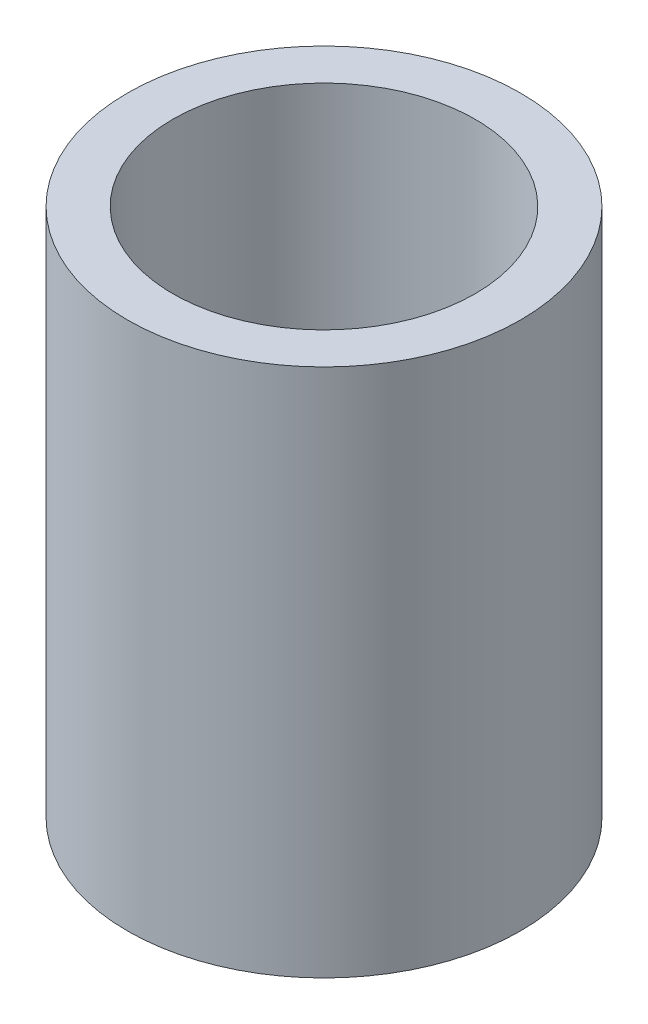
ISO-10303-21;
HEADER;
FILE_DESCRIPTION(('STEP AP214'),'2;1');
FILE_NAME('part.step','',(''),(''),'','','');
FILE_SCHEMA(('AUTOMOTIVE_DESIGN { 1 0 10303 214 1 1 1 1 }'));
ENDSEC;
DATA;
#1=APPLICATION_CONTEXT('core data for automotive mechanical design processes');
#2=APPLICATION_PROTOCOL_DEFINITION('international standard','automotive_design',2000,#1);
#3=PRODUCT_CONTEXT('',#1,'mechanical');
#4=PRODUCT('Part','Part','',(#3));
#5=PRODUCT_RELATED_PRODUCT_CATEGORY('part','',(#4));
#6=PRODUCT_DEFINITION_FORMATION('','',#4);
#7=PRODUCT_DEFINITION_CONTEXT('part definition',#1,'design');
#8=PRODUCT_DEFINITION('design','',#6,#7);
#9=PRODUCT_DEFINITION_SHAPE('','',#8);
#10=(LENGTH_UNIT() NAMED_UNIT(*) SI_UNIT(.MILLI.,.METRE.));
#11=(NAMED_UNIT(*) PLANE_ANGLE_UNIT() SI_UNIT($,.RADIAN.));
#12=(NAMED_UNIT(*) SI_UNIT($,.STERADIAN.) SOLID_ANGLE_UNIT());
#13=UNCERTAINTY_MEASURE_WITH_UNIT(LENGTH_MEASURE(1.E-05),#10,'distance_accuracy_value','');
#14=(GEOMETRIC_REPRESENTATION_CONTEXT(3) GLOBAL_UNCERTAINTY_ASSIGNED_CONTEXT((#13)) GLOBAL_UNIT_ASSIGNED_CONTEXT((#10,
#11,#12)) REPRESENTATION_CONTEXT('',''));
#15=CARTESIAN_POINT('',(0.,0.,0.));
#16=DIRECTION('',(0.,0.,1.));
#17=DIRECTION('',(1.,0.,0.));
#18=AXIS2_PLACEMENT_3D('',#15,#16,#17);
#19=CARTESIAN_POINT('',(0.,70.,0.));
#20=DIRECTION('',(0.,1.,0.));
#21=DIRECTION('',(0.,0.,1.));
#22=AXIS2_PLACEMENT_3D('',#19,#20,#21);
#23=PLANE('',#22);
#24=CARTESIAN_POINT('',(0.,70.,0.));
#25=DIRECTION('',(0.,1.,0.));
#26=DIRECTION('',(1.,0.,0.));
#27=AXIS2_PLACEMENT_3D('',#24,#25,#26);
#28=CIRCLE('',#27,26.);
#29=CARTESIAN_POINT('',(26.,70.,0.));
#30=VERTEX_POINT('',#29);
#31=EDGE_CURVE('E11',#30,#30,#28,.T.);
#32=ORIENTED_EDGE('',*,*,#31,.T.);
#33=EDGE_LOOP('',(#32));
#34=FACE_BOUND('',#33,.T.);
#35=CARTESIAN_POINT('',(0.,70.,0.));
#36=DIRECTION('',(0.,1.,0.));
#37=DIRECTION('',(1.,0.,0.));
#38=AXIS2_PLACEMENT_3D('',#35,#36,#37);
#39=CIRCLE('',#38,20.);
#40=CARTESIAN_POINT('',(20.,70.,0.));
#41=VERTEX_POINT('',#40);
#42=EDGE_CURVE('E62',#41,#41,#39,.T.);
#43=ORIENTED_EDGE('',*,*,#42,.F.);
#44=EDGE_LOOP('',(#43));
#45=FACE_BOUND('',#44,.T.);
#46=ADVANCED_FACE('F47',(#34,#45),#23,.T.);
#47=CARTESIAN_POINT('',(0.,0.,0.));
#48=DIRECTION('',(0.,1.,0.));
#49=DIRECTION('',(0.,0.,1.));
#50=AXIS2_PLACEMENT_3D('',#47,#48,#49);
#51=PLANE('',#50);
#52=CARTESIAN_POINT('',(0.,0.,0.));
#53=DIRECTION('',(0.,1.,0.));
#54=DIRECTION('',(1.,0.,0.));
#55=AXIS2_PLACEMENT_3D('',#52,#53,#54);
#56=CIRCLE('',#55,26.);
#57=CARTESIAN_POINT('',(26.,0.,0.));
#58=VERTEX_POINT('',#57);
#59=EDGE_CURVE('E51',#58,#58,#56,.T.);
#60=ORIENTED_EDGE('',*,*,#59,.F.);
#61=EDGE_LOOP('',(#60));
#62=FACE_BOUND('',#61,.T.);
#63=CARTESIAN_POINT('',(0.,0.,0.));
#64=DIRECTION('',(0.,1.,0.));
#65=DIRECTION('',(1.,0.,0.));
#66=AXIS2_PLACEMENT_3D('',#63,#64,#65);
#67=CIRCLE('',#66,20.);
#68=CARTESIAN_POINT('',(20.,0.,0.));
#69=VERTEX_POINT('',#68);
#70=EDGE_CURVE('E64',#69,#69,#67,.T.);
#71=ORIENTED_EDGE('',*,*,#70,.T.);
#72=EDGE_LOOP('',(#71));
#73=FACE_BOUND('',#72,.T.);
#74=ADVANCED_FACE('F74',(#62,#73),#51,.F.);
#75=CARTESIAN_POINT('',(0.,70.,0.));
#76=DIRECTION('',(0.,-1.,0.));
#77=DIRECTION('',(0.,0.,-1.));
#78=AXIS2_PLACEMENT_3D('',#75,#76,#77);
#79=CYLINDRICAL_SURFACE('',#78,26.);
#80=ORIENTED_EDGE('',*,*,#31,.F.);
#81=EDGE_LOOP('',(#80));
#82=FACE_BOUND('',#81,.T.);
#83=ORIENTED_EDGE('',*,*,#59,.T.);
#84=EDGE_LOOP('',(#83));
#85=FACE_BOUND('',#84,.T.);
#86=ADVANCED_FACE('F49',(#82,#85),#79,.T.);
#87=CARTESIAN_POINT('',(0.,70.,0.));
#88=DIRECTION('',(0.,-1.,0.));
#89=DIRECTION('',(0.,0.,-1.));
#90=AXIS2_PLACEMENT_3D('',#87,#88,#89);
#91=CYLINDRICAL_SURFACE('',#90,20.);
#92=ORIENTED_EDGE('',*,*,#42,.T.);
#93=EDGE_LOOP('',(#92));
#94=FACE_BOUND('',#93,.T.);
#95=ORIENTED_EDGE('',*,*,#70,.F.);
#96=EDGE_LOOP('',(#95));
#97=FACE_BOUND('',#96,.T.);
#98=ADVANCED_FACE('F70',(#94,#97),#91,.F.);
#99=CLOSED_SHELL('',(#46,#74,#86,#98));
#100=MANIFOLD_SOLID_BREP('B2',#99);
#101=ADVANCED_BREP_SHAPE_REPRESENTATION('',(#18,#100),#14);
#102=SHAPE_DEFINITION_REPRESENTATION(#9,#101);
ENDSEC;
END-ISO-10303-21;
